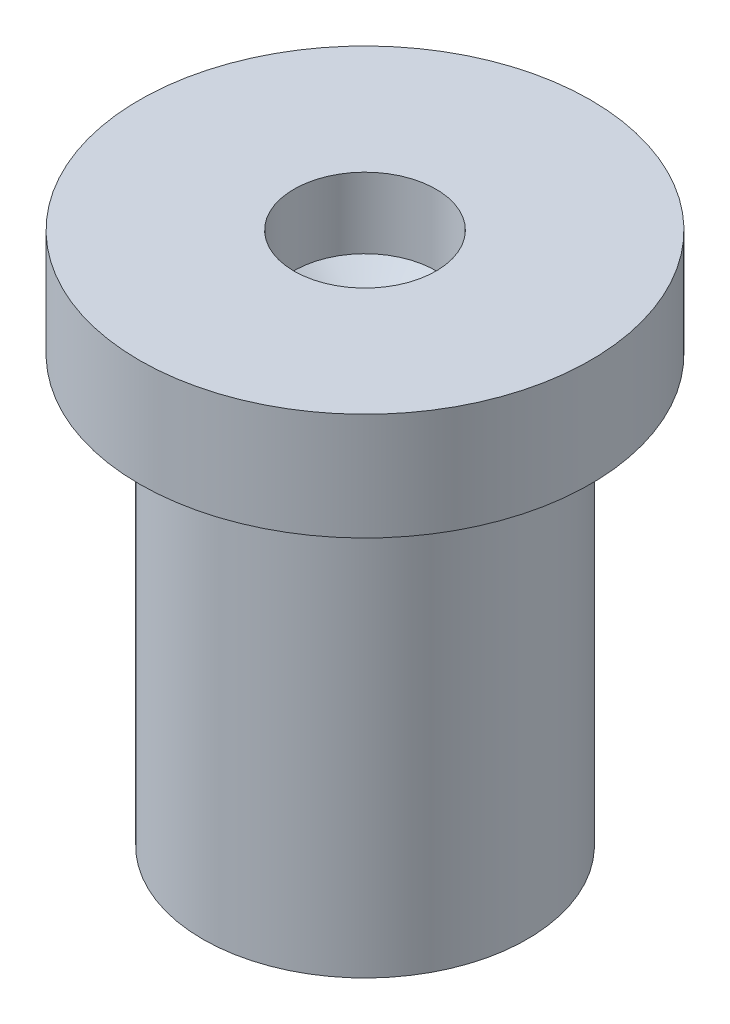
ISO-10303-21;
HEADER;
FILE_DESCRIPTION(('STEP AP214'),'2;1');
FILE_NAME('part.step','',(''),(''),'','','');
FILE_SCHEMA(('AUTOMOTIVE_DESIGN { 1 0 10303 214 1 1 1 1 }'));
ENDSEC;
DATA;
#1=APPLICATION_CONTEXT('core data for automotive mechanical design processes');
#2=APPLICATION_PROTOCOL_DEFINITION('international standard','automotive_design',2000,#1);
#3=PRODUCT_CONTEXT('',#1,'mechanical');
#4=PRODUCT('Part','Part','',(#3));
#5=PRODUCT_RELATED_PRODUCT_CATEGORY('part','',(#4));
#6=PRODUCT_DEFINITION_FORMATION('','',#4);
#7=PRODUCT_DEFINITION_CONTEXT('part definition',#1,'design');
#8=PRODUCT_DEFINITION('design','',#6,#7);
#9=PRODUCT_DEFINITION_SHAPE('','',#8);
#10=(LENGTH_UNIT() NAMED_UNIT(*) SI_UNIT(.MILLI.,.METRE.));
#11=(NAMED_UNIT(*) PLANE_ANGLE_UNIT() SI_UNIT($,.RADIAN.));
#12=(NAMED_UNIT(*) SI_UNIT($,.STERADIAN.) SOLID_ANGLE_UNIT());
#13=UNCERTAINTY_MEASURE_WITH_UNIT(LENGTH_MEASURE(1.E-05),#10,'distance_accuracy_value','');
#14=(GEOMETRIC_REPRESENTATION_CONTEXT(3) GLOBAL_UNCERTAINTY_ASSIGNED_CONTEXT((#13)) GLOBAL_UNIT_ASSIGNED_CONTEXT((#10,
#11,#12)) REPRESENTATION_CONTEXT('',''));
#15=CARTESIAN_POINT('',(0.,0.,0.));
#16=DIRECTION('',(0.,0.,1.));
#17=DIRECTION('',(1.,0.,0.));
#18=AXIS2_PLACEMENT_3D('',#15,#16,#17);
#19=CARTESIAN_POINT('',(0.,-4.69354838709677,0.));
#20=DIRECTION('',(0.,1.,0.));
#21=DIRECTION('',(0.,0.,1.));
#22=AXIS2_PLACEMENT_3D('',#19,#20,#21);
#23=PLANE('',#22);
#24=CARTESIAN_POINT('',(0.,-4.69354838709677,0.));
#25=DIRECTION('',(0.,1.,0.));
#26=DIRECTION('',(0.,0.,1.));
#27=AXIS2_PLACEMENT_3D('',#24,#25,#26);
#28=CIRCLE('',#27,4.);
#29=CARTESIAN_POINT('',(0.,-4.69354838709677,4.));
#30=VERTEX_POINT('',#29);
#31=EDGE_CURVE('E11',#30,#30,#28,.T.);
#32=ORIENTED_EDGE('',*,*,#31,.F.);
#33=EDGE_LOOP('',(#32));
#34=FACE_BOUND('',#33,.T.);
#35=ADVANCED_FACE('F41',(#34),#23,.F.);
#36=CARTESIAN_POINT('',(0.,7.04838709677418,0.));
#37=DIRECTION('',(0.,1.,0.));
#38=DIRECTION('',(0.,0.,1.));
#39=AXIS2_PLACEMENT_3D('',#36,#37,#38);
#40=CYLINDRICAL_SURFACE('',#39,4.);
#41=CARTESIAN_POINT('',(0.,5.80645161290324,0.));
#42=DIRECTION('',(0.,1.,0.));
#43=DIRECTION('',(0.,0.,1.));
#44=AXIS2_PLACEMENT_3D('',#41,#42,#43);
#45=CIRCLE('',#44,4.);
#46=CARTESIAN_POINT('',(0.,5.80645161290324,4.));
#47=VERTEX_POINT('',#46);
#48=EDGE_CURVE('E48',#47,#47,#45,.T.);
#49=ORIENTED_EDGE('',*,*,#48,.F.);
#50=EDGE_LOOP('',(#49));
#51=FACE_BOUND('',#50,.T.);
#52=ORIENTED_EDGE('',*,*,#31,.T.);
#53=EDGE_LOOP('',(#52));
#54=FACE_BOUND('',#53,.T.);
#55=ADVANCED_FACE('F80',(#51,#54),#40,.T.);
#56=CARTESIAN_POINT('',(4.,5.80645161290324,0.));
#57=DIRECTION('',(0.,1.,0.));
#58=DIRECTION('',(0.,0.,1.));
#59=AXIS2_PLACEMENT_3D('',#56,#57,#58);
#60=PLANE('',#59);
#61=CARTESIAN_POINT('',(0.,5.80645161290324,0.));
#62=DIRECTION('',(0.,1.,0.));
#63=DIRECTION('',(0.,0.,1.));
#64=AXIS2_PLACEMENT_3D('',#61,#62,#63);
#65=CIRCLE('',#64,5.56160588694388);
#66=CARTESIAN_POINT('',(0.,5.80645161290324,5.56160588694388));
#67=VERTEX_POINT('',#66);
#68=EDGE_CURVE('E71',#67,#67,#65,.T.);
#69=ORIENTED_EDGE('',*,*,#68,.F.);
#70=EDGE_LOOP('',(#69));
#71=FACE_BOUND('',#70,.T.);
#72=ORIENTED_EDGE('',*,*,#48,.T.);
#73=EDGE_LOOP('',(#72));
#74=FACE_BOUND('',#73,.T.);
#75=ADVANCED_FACE('F78',(#71,#74),#60,.F.);
#76=CARTESIAN_POINT('',(0.,7.04838709677418,0.));
#77=DIRECTION('',(0.,1.,0.));
#78=DIRECTION('',(0.,0.,1.));
#79=AXIS2_PLACEMENT_3D('',#76,#77,#78);
#80=CYLINDRICAL_SURFACE('',#79,5.56160588694388);
#81=CARTESIAN_POINT('',(0.,8.44943279390545,0.));
#82=DIRECTION('',(0.,1.,0.));
#83=DIRECTION('',(0.,0.,1.));
#84=AXIS2_PLACEMENT_3D('',#81,#82,#83);
#85=CIRCLE('',#84,5.56160588694388);
#86=CARTESIAN_POINT('',(0.,8.44943279390545,5.56160588694388));
#87=VERTEX_POINT('',#86);
#88=EDGE_CURVE('E65',#87,#87,#85,.T.);
#89=ORIENTED_EDGE('',*,*,#88,.F.);
#90=EDGE_LOOP('',(#89));
#91=FACE_BOUND('',#90,.T.);
#92=ORIENTED_EDGE('',*,*,#68,.T.);
#93=EDGE_LOOP('',(#92));
#94=FACE_BOUND('',#93,.T.);
#95=ADVANCED_FACE('F98',(#91,#94),#80,.T.);
#96=CARTESIAN_POINT('',(5.56160588694388,8.44943279390545,0.));
#97=DIRECTION('',(0.,-1.,0.));
#98=DIRECTION('',(0.,0.,-1.));
#99=AXIS2_PLACEMENT_3D('',#96,#97,#98);
#100=PLANE('',#99);
#101=CARTESIAN_POINT('',(0.,8.44943279390545,0.));
#102=DIRECTION('',(0.,1.,0.));
#103=DIRECTION('',(0.,0.,1.));
#104=AXIS2_PLACEMENT_3D('',#101,#102,#103);
#105=CIRCLE('',#104,1.75097041500428);
#106=CARTESIAN_POINT('',(0.,8.44943279390545,1.75097041500428));
#107=VERTEX_POINT('',#106);
#108=EDGE_CURVE('E61',#107,#107,#105,.T.);
#109=ORIENTED_EDGE('',*,*,#108,.F.);
#110=EDGE_LOOP('',(#109));
#111=FACE_BOUND('',#110,.T.);
#112=ORIENTED_EDGE('',*,*,#88,.T.);
#113=EDGE_LOOP('',(#112));
#114=FACE_BOUND('',#113,.T.);
#115=ADVANCED_FACE('F106',(#111,#114),#100,.F.);
#116=CARTESIAN_POINT('',(0.,7.04838709677418,0.));
#117=DIRECTION('',(0.,1.,0.));
#118=DIRECTION('',(0.,0.,1.));
#119=AXIS2_PLACEMENT_3D('',#116,#117,#118);
#120=CYLINDRICAL_SURFACE('',#119,1.75097041500428);
#121=CARTESIAN_POINT('',(0.,6.70761644546225,0.));
#122=DIRECTION('',(0.,1.,0.));
#123=DIRECTION('',(0.,0.,1.));
#124=AXIS2_PLACEMENT_3D('',#121,#122,#123);
#125=CIRCLE('',#124,1.75097041500428);
#126=CARTESIAN_POINT('',(0.,6.70761644546225,1.75097041500428));
#127=VERTEX_POINT('',#126);
#128=EDGE_CURVE('E58',#127,#127,#125,.T.);
#129=ORIENTED_EDGE('',*,*,#128,.F.);
#130=EDGE_LOOP('',(#129));
#131=FACE_BOUND('',#130,.T.);
#132=ORIENTED_EDGE('',*,*,#108,.T.);
#133=EDGE_LOOP('',(#132));
#134=FACE_BOUND('',#133,.T.);
#135=ADVANCED_FACE('F54',(#131,#134),#120,.F.);
#136=CARTESIAN_POINT('',(0.,6.70761644546225,0.));
#137=DIRECTION('',(0.,1.,0.));
#138=DIRECTION('',(0.,0.,1.));
#139=AXIS2_PLACEMENT_3D('',#136,#137,#138);
#140=CONICAL_SURFACE('',#139,1.75097041500428,0.978878413604619);
#141=CARTESIAN_POINT('',(0.,5.53037434848657,0.));
#142=VERTEX_POINT('',#141);
#143=VERTEX_LOOP('',#142);
#144=FACE_BOUND('',#143,.T.);
#145=ORIENTED_EDGE('',*,*,#128,.T.);
#146=EDGE_LOOP('',(#145));
#147=FACE_BOUND('',#146,.T.);
#148=ADVANCED_FACE('F51',(#144,#147),#140,.F.);
#149=CLOSED_SHELL('',(#35,#55,#75,#95,#115,#135,#148));
#150=MANIFOLD_SOLID_BREP('B2',#149);
#151=ADVANCED_BREP_SHAPE_REPRESENTATION('',(#18,#150),#14);
#152=SHAPE_DEFINITION_REPRESENTATION(#9,#151);
ENDSEC;
END-ISO-10303-21;
